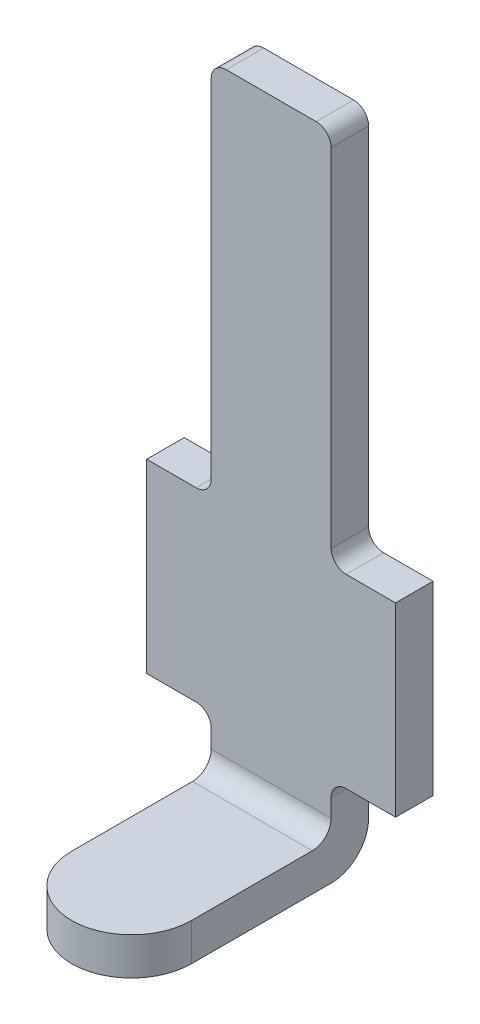
ISO-10303-21;
HEADER;
FILE_DESCRIPTION(('STEP AP214'),'2;1');
FILE_NAME('part.step','',(''),(''),'','','');
FILE_SCHEMA(('AUTOMOTIVE_DESIGN { 1 0 10303 214 1 1 1 1 }'));
ENDSEC;
DATA;
#1=APPLICATION_CONTEXT('core data for automotive mechanical design processes');
#2=APPLICATION_PROTOCOL_DEFINITION('international standard','automotive_design',2000,#1);
#3=PRODUCT_CONTEXT('',#1,'mechanical');
#4=PRODUCT('Part','Part','',(#3));
#5=PRODUCT_RELATED_PRODUCT_CATEGORY('part','',(#4));
#6=PRODUCT_DEFINITION_FORMATION('','',#4);
#7=PRODUCT_DEFINITION_CONTEXT('part definition',#1,'design');
#8=PRODUCT_DEFINITION('design','',#6,#7);
#9=PRODUCT_DEFINITION_SHAPE('','',#8);
#10=(LENGTH_UNIT() NAMED_UNIT(*) SI_UNIT(.MILLI.,.METRE.));
#11=(NAMED_UNIT(*) PLANE_ANGLE_UNIT() SI_UNIT($,.RADIAN.));
#12=(NAMED_UNIT(*) SI_UNIT($,.STERADIAN.) SOLID_ANGLE_UNIT());
#13=UNCERTAINTY_MEASURE_WITH_UNIT(LENGTH_MEASURE(1.E-05),#10,'distance_accuracy_value','');
#14=(GEOMETRIC_REPRESENTATION_CONTEXT(3) GLOBAL_UNCERTAINTY_ASSIGNED_CONTEXT((#13)) GLOBAL_UNIT_ASSIGNED_CONTEXT((#10,
#11,#12)) REPRESENTATION_CONTEXT('',''));
#15=CARTESIAN_POINT('',(0.,0.,0.));
#16=DIRECTION('',(0.,0.,1.));
#17=DIRECTION('',(1.,0.,0.));
#18=AXIS2_PLACEMENT_3D('',#15,#16,#17);
#19=CARTESIAN_POINT('',(3.31,0.0459658151929143,0.749000000000012));
#20=DIRECTION('',(0.,0.,-1.));
#21=DIRECTION('',(-1.,0.,0.));
#22=AXIS2_PLACEMENT_3D('',#19,#20,#21);
#23=CYLINDRICAL_SURFACE('',#22,0.1);
#24=CARTESIAN_POINT('',(3.31,0.0459658151929143,0.498999999999983));
#25=DIRECTION('',(0.,0.,1.));
#26=DIRECTION('',(1.,0.,0.));
#27=AXIS2_PLACEMENT_3D('',#24,#25,#26);
#28=CIRCLE('',#27,0.1);
#29=CARTESIAN_POINT('',(3.41,0.0459658151929143,0.498999999999983));
#30=VERTEX_POINT('',#29);
#31=CARTESIAN_POINT('',(3.31,0.145965815192914,0.499000000000012));
#32=VERTEX_POINT('',#31);
#33=EDGE_CURVE('E338',#30,#32,#28,.T.);
#34=ORIENTED_EDGE('',*,*,#33,.F.);
#35=DIRECTION('',(0.,0.,-1.));
#36=VECTOR('',#35,1.);
#37=CARTESIAN_POINT('',(3.41,0.0459658151929143,0.499000000000012));
#38=LINE('',#37,#36);
#39=CARTESIAN_POINT('',(3.41,0.0459658151929143,0.748999999999983));
#40=VERTEX_POINT('',#39);
#41=EDGE_CURVE('E293',#40,#30,#38,.T.);
#42=ORIENTED_EDGE('',*,*,#41,.F.);
#43=CARTESIAN_POINT('',(3.31,0.0459658151929143,0.748999999999983));
#44=DIRECTION('',(0.,0.,-1.));
#45=DIRECTION('',(-1.,0.,0.));
#46=AXIS2_PLACEMENT_3D('',#43,#44,#45);
#47=CIRCLE('',#46,0.1);
#48=CARTESIAN_POINT('',(3.31,0.145965815192914,0.749000000000012));
#49=VERTEX_POINT('',#48);
#50=EDGE_CURVE('E237',#49,#40,#47,.T.);
#51=ORIENTED_EDGE('',*,*,#50,.F.);
#52=DIRECTION('',(0.,0.,1.));
#53=VECTOR('',#52,1.);
#54=CARTESIAN_POINT('',(3.31,0.145965815192914,0.748999999999983));
#55=LINE('',#54,#53);
#56=EDGE_CURVE('E225',#32,#49,#55,.T.);
#57=ORIENTED_EDGE('',*,*,#56,.F.);
#58=EDGE_LOOP('',(#34,#42,#51,#57));
#59=FACE_BOUND('',#58,.T.);
#60=ADVANCED_FACE('F16',(#59),#23,.F.);
#61=CARTESIAN_POINT('',(4.31,0.0459658151929143,0.748999999999984));
#62=DIRECTION('',(0.,0.,1.));
#63=DIRECTION('',(1.,0.,0.));
#64=AXIS2_PLACEMENT_3D('',#61,#62,#63);
#65=CYLINDRICAL_SURFACE('',#64,0.1);
#66=CARTESIAN_POINT('',(4.31,0.0459658151929143,0.498999999999984));
#67=DIRECTION('',(0.,0.,1.));
#68=DIRECTION('',(1.,0.,0.));
#69=AXIS2_PLACEMENT_3D('',#66,#67,#68);
#70=CIRCLE('',#69,0.1);
#71=CARTESIAN_POINT('',(4.31,0.145965815192914,0.499000000000013));
#72=VERTEX_POINT('',#71);
#73=CARTESIAN_POINT('',(4.21,0.0459658151929143,0.498999999999984));
#74=VERTEX_POINT('',#73);
#75=EDGE_CURVE('E236',#72,#74,#70,.T.);
#76=ORIENTED_EDGE('',*,*,#75,.F.);
#77=DIRECTION('',(0.,0.,-1.));
#78=VECTOR('',#77,1.);
#79=CARTESIAN_POINT('',(4.31,0.145965815192914,0.749000000000013));
#80=LINE('',#79,#78);
#81=CARTESIAN_POINT('',(4.31,0.145965815192914,0.749000000000013));
#82=VERTEX_POINT('',#81);
#83=EDGE_CURVE('E27',#82,#72,#80,.T.);
#84=ORIENTED_EDGE('',*,*,#83,.F.);
#85=CARTESIAN_POINT('',(4.31,0.0459658151929143,0.748999999999984));
#86=DIRECTION('',(0.,0.,-1.));
#87=DIRECTION('',(-1.,0.,0.));
#88=AXIS2_PLACEMENT_3D('',#85,#86,#87);
#89=CIRCLE('',#88,0.1);
#90=CARTESIAN_POINT('',(4.21,0.0459658151929143,0.748999999999984));
#91=VERTEX_POINT('',#90);
#92=EDGE_CURVE('E387',#91,#82,#89,.T.);
#93=ORIENTED_EDGE('',*,*,#92,.F.);
#94=DIRECTION('',(0.,0.,1.));
#95=VECTOR('',#94,1.);
#96=CARTESIAN_POINT('',(4.21,0.0459658151929143,0.748999999999984));
#97=LINE('',#96,#95);
#98=EDGE_CURVE('E260',#74,#91,#97,.T.);
#99=ORIENTED_EDGE('',*,*,#98,.F.);
#100=EDGE_LOOP('',(#76,#84,#93,#99));
#101=FACE_BOUND('',#100,.T.);
#102=ADVANCED_FACE('F637',(#101),#65,.F.);
#103=CARTESIAN_POINT('',(3.31,1.48437551370885,0.748999999999983));
#104=DIRECTION('',(0.,0.,1.));
#105=DIRECTION('',(1.,0.,0.));
#106=AXIS2_PLACEMENT_3D('',#103,#104,#105);
#107=CYLINDRICAL_SURFACE('',#106,0.1);
#108=CARTESIAN_POINT('',(3.31,1.48437551370885,0.498999999999983));
#109=DIRECTION('',(0.,0.,1.));
#110=DIRECTION('',(1.,0.,0.));
#111=AXIS2_PLACEMENT_3D('',#108,#109,#110);
#112=CIRCLE('',#111,0.1);
#113=CARTESIAN_POINT('',(3.31,1.38437551370885,0.499000000000012));
#114=VERTEX_POINT('',#113);
#115=CARTESIAN_POINT('',(3.41,1.48437551370885,0.498999999999983));
#116=VERTEX_POINT('',#115);
#117=EDGE_CURVE('E255',#114,#116,#112,.T.);
#118=ORIENTED_EDGE('',*,*,#117,.F.);
#119=DIRECTION('',(0.,0.,-1.));
#120=VECTOR('',#119,1.);
#121=CARTESIAN_POINT('',(3.31,1.38437551370885,0.749000000000012));
#122=LINE('',#121,#120);
#123=CARTESIAN_POINT('',(3.31,1.38437551370885,0.749000000000012));
#124=VERTEX_POINT('',#123);
#125=EDGE_CURVE('E42',#124,#114,#122,.T.);
#126=ORIENTED_EDGE('',*,*,#125,.F.);
#127=CARTESIAN_POINT('',(3.31,1.48437551370885,0.748999999999983));
#128=DIRECTION('',(0.,0.,-1.));
#129=DIRECTION('',(-1.,0.,0.));
#130=AXIS2_PLACEMENT_3D('',#127,#128,#129);
#131=CIRCLE('',#130,0.1);
#132=CARTESIAN_POINT('',(3.41,1.48437551370885,0.748999999999983));
#133=VERTEX_POINT('',#132);
#134=EDGE_CURVE('E264',#133,#124,#131,.T.);
#135=ORIENTED_EDGE('',*,*,#134,.F.);
#136=DIRECTION('',(0.,0.,1.));
#137=VECTOR('',#136,1.);
#138=CARTESIAN_POINT('',(3.41,1.48437551370885,0.748999999999983));
#139=LINE('',#138,#137);
#140=EDGE_CURVE('E231',#116,#133,#139,.T.);
#141=ORIENTED_EDGE('',*,*,#140,.F.);
#142=EDGE_LOOP('',(#118,#126,#135,#141));
#143=FACE_BOUND('',#142,.T.);
#144=ADVANCED_FACE('F681',(#143),#107,.F.);
#145=CARTESIAN_POINT('',(4.31,1.48437551370885,0.749000000000014));
#146=DIRECTION('',(0.,0.,-1.));
#147=DIRECTION('',(-1.,0.,0.));
#148=AXIS2_PLACEMENT_3D('',#145,#146,#147);
#149=CYLINDRICAL_SURFACE('',#148,0.1);
#150=CARTESIAN_POINT('',(4.31,1.48437551370885,0.498999999999985));
#151=DIRECTION('',(0.,0.,1.));
#152=DIRECTION('',(1.,0.,0.));
#153=AXIS2_PLACEMENT_3D('',#150,#151,#152);
#154=CIRCLE('',#153,0.1);
#155=CARTESIAN_POINT('',(4.21,1.48437551370885,0.498999999999984));
#156=VERTEX_POINT('',#155);
#157=CARTESIAN_POINT('',(4.31,1.38437551370885,0.499000000000013));
#158=VERTEX_POINT('',#157);
#159=EDGE_CURVE('E379',#156,#158,#154,.T.);
#160=ORIENTED_EDGE('',*,*,#159,.F.);
#161=DIRECTION('',(0.,0.,-1.));
#162=VECTOR('',#161,1.);
#163=CARTESIAN_POINT('',(4.21,1.48437551370885,0.498999999999984));
#164=LINE('',#163,#162);
#165=CARTESIAN_POINT('',(4.21,1.48437551370885,0.748999999999984));
#166=VERTEX_POINT('',#165);
#167=EDGE_CURVE('E280',#166,#156,#164,.T.);
#168=ORIENTED_EDGE('',*,*,#167,.F.);
#169=CARTESIAN_POINT('',(4.31,1.48437551370885,0.748999999999984));
#170=DIRECTION('',(0.,0.,-1.));
#171=DIRECTION('',(-1.,0.,0.));
#172=AXIS2_PLACEMENT_3D('',#169,#170,#171);
#173=CIRCLE('',#172,0.1);
#174=CARTESIAN_POINT('',(4.31,1.38437551370885,0.749000000000014));
#175=VERTEX_POINT('',#174);
#176=EDGE_CURVE('E221',#175,#166,#173,.T.);
#177=ORIENTED_EDGE('',*,*,#176,.F.);
#178=DIRECTION('',(0.,0.,1.));
#179=VECTOR('',#178,1.);
#180=CARTESIAN_POINT('',(4.31,1.38437551370885,0.748999999999984));
#181=LINE('',#180,#179);
#182=EDGE_CURVE('E374',#158,#175,#181,.T.);
#183=ORIENTED_EDGE('',*,*,#182,.F.);
#184=EDGE_LOOP('',(#160,#168,#177,#183));
#185=FACE_BOUND('',#184,.T.);
#186=ADVANCED_FACE('F705',(#185),#149,.F.);
#187=CARTESIAN_POINT('',(3.51,3.8,0.748999999999983));
#188=DIRECTION('',(0.,0.,-1.));
#189=DIRECTION('',(-1.,0.,0.));
#190=AXIS2_PLACEMENT_3D('',#187,#188,#189);
#191=CYLINDRICAL_SURFACE('',#190,0.1);
#192=CARTESIAN_POINT('',(3.51,3.8,0.498999999999984));
#193=DIRECTION('',(0.,0.,-1.));
#194=DIRECTION('',(1.,0.,0.));
#195=AXIS2_PLACEMENT_3D('',#192,#193,#194);
#196=CIRCLE('',#195,0.1);
#197=CARTESIAN_POINT('',(3.41,3.8,0.498999999999984));
#198=VERTEX_POINT('',#197);
#199=CARTESIAN_POINT('',(3.51,3.9,0.498999999999984));
#200=VERTEX_POINT('',#199);
#201=EDGE_CURVE('E258',#198,#200,#196,.T.);
#202=ORIENTED_EDGE('',*,*,#201,.F.);
#203=DIRECTION('',(0.,0.,-1.));
#204=VECTOR('',#203,1.);
#205=CARTESIAN_POINT('',(3.41,3.8,0.498999999999984));
#206=LINE('',#205,#204);
#207=CARTESIAN_POINT('',(3.41,3.8,0.748999999999983));
#208=VERTEX_POINT('',#207);
#209=EDGE_CURVE('E394',#208,#198,#206,.T.);
#210=ORIENTED_EDGE('',*,*,#209,.F.);
#211=CARTESIAN_POINT('',(3.51,3.8,0.748999999999983));
#212=DIRECTION('',(0.,0.,1.));
#213=DIRECTION('',(-1.,0.,0.));
#214=AXIS2_PLACEMENT_3D('',#211,#212,#213);
#215=CIRCLE('',#214,0.1);
#216=CARTESIAN_POINT('',(3.51,3.9,0.748999999999983));
#217=VERTEX_POINT('',#216);
#218=EDGE_CURVE('E269',#217,#208,#215,.T.);
#219=ORIENTED_EDGE('',*,*,#218,.F.);
#220=DIRECTION('',(0.,0.,1.));
#221=VECTOR('',#220,1.);
#222=CARTESIAN_POINT('',(3.51,3.9,0.748999999999983));
#223=LINE('',#222,#221);
#224=EDGE_CURVE('E286',#200,#217,#223,.T.);
#225=ORIENTED_EDGE('',*,*,#224,.F.);
#226=EDGE_LOOP('',(#202,#210,#219,#225));
#227=FACE_BOUND('',#226,.T.);
#228=ADVANCED_FACE('F357',(#227),#191,.T.);
#229=CARTESIAN_POINT('',(4.11,3.8,0.748999999999984));
#230=DIRECTION('',(0.,0.,1.));
#231=DIRECTION('',(1.,0.,0.));
#232=AXIS2_PLACEMENT_3D('',#229,#230,#231);
#233=CYLINDRICAL_SURFACE('',#232,0.1);
#234=CARTESIAN_POINT('',(4.11,3.8,0.498999999999985));
#235=DIRECTION('',(0.,0.,-1.));
#236=DIRECTION('',(1.,0.,0.));
#237=AXIS2_PLACEMENT_3D('',#234,#235,#236);
#238=CIRCLE('',#237,0.1);
#239=CARTESIAN_POINT('',(4.11,3.9,0.498999999999985));
#240=VERTEX_POINT('',#239);
#241=CARTESIAN_POINT('',(4.21,3.8,0.498999999999985));
#242=VERTEX_POINT('',#241);
#243=EDGE_CURVE('E20',#240,#242,#238,.T.);
#244=ORIENTED_EDGE('',*,*,#243,.F.);
#245=DIRECTION('',(0.,0.,-1.));
#246=VECTOR('',#245,1.);
#247=CARTESIAN_POINT('',(4.11,3.9,0.748999999999984));
#248=LINE('',#247,#246);
#249=CARTESIAN_POINT('',(4.11,3.9,0.748999999999984));
#250=VERTEX_POINT('',#249);
#251=EDGE_CURVE('E230',#250,#240,#248,.T.);
#252=ORIENTED_EDGE('',*,*,#251,.F.);
#253=CARTESIAN_POINT('',(4.11,3.8,0.748999999999984));
#254=DIRECTION('',(0.,0.,1.));
#255=DIRECTION('',(-1.,0.,0.));
#256=AXIS2_PLACEMENT_3D('',#253,#254,#255);
#257=CIRCLE('',#256,0.1);
#258=CARTESIAN_POINT('',(4.21,3.8,0.748999999999984));
#259=VERTEX_POINT('',#258);
#260=EDGE_CURVE('E290',#259,#250,#257,.T.);
#261=ORIENTED_EDGE('',*,*,#260,.F.);
#262=DIRECTION('',(0.,0.,1.));
#263=VECTOR('',#262,1.);
#264=CARTESIAN_POINT('',(4.21,3.8,0.748999999999984));
#265=LINE('',#264,#263);
#266=EDGE_CURVE('E411',#242,#259,#265,.T.);
#267=ORIENTED_EDGE('',*,*,#266,.F.);
#268=EDGE_LOOP('',(#244,#252,#261,#267));
#269=FACE_BOUND('',#268,.T.);
#270=ADVANCED_FACE('F745',(#269),#233,.T.);
#271=CARTESIAN_POINT('',(4.64,0.,1.00308650274883E-13));
#272=DIRECTION('',(-1.,0.,0.));
#273=DIRECTION('',(0.,0.,1.));
#274=AXIS2_PLACEMENT_3D('',#271,#272,#273);
#275=PLANE('',#274);
#276=DIRECTION('',(0.,0.,-1.));
#277=VECTOR('',#276,1.);
#278=CARTESIAN_POINT('',(4.64,1.38437551370885,0.749000000000014));
#279=LINE('',#278,#277);
#280=CARTESIAN_POINT('',(4.64,1.38437551370885,0.749000000000014));
#281=VERTEX_POINT('',#280);
#282=CARTESIAN_POINT('',(4.64,1.38437551370885,0.499000000000014));
#283=VERTEX_POINT('',#282);
#284=EDGE_CURVE('E279',#281,#283,#279,.T.);
#285=ORIENTED_EDGE('',*,*,#284,.F.);
#286=DIRECTION('',(0.,-1.,0.));
#287=VECTOR('',#286,1.);
#288=CARTESIAN_POINT('',(4.64,1.38437551370885,0.749000000000014));
#289=LINE('',#288,#287);
#290=CARTESIAN_POINT('',(4.64,0.145965815192914,0.749000000000014));
#291=VERTEX_POINT('',#290);
#292=EDGE_CURVE('E402',#281,#291,#289,.T.);
#293=ORIENTED_EDGE('',*,*,#292,.T.);
#294=DIRECTION('',(0.,0.,-1.));
#295=VECTOR('',#294,1.);
#296=CARTESIAN_POINT('',(4.64,0.145965815192914,0.749000000000014));
#297=LINE('',#296,#295);
#298=CARTESIAN_POINT('',(4.64,0.145965815192914,0.499000000000014));
#299=VERTEX_POINT('',#298);
#300=EDGE_CURVE('E11',#291,#299,#297,.T.);
#301=ORIENTED_EDGE('',*,*,#300,.T.);
#302=DIRECTION('',(0.,-1.,0.));
#303=VECTOR('',#302,1.);
#304=CARTESIAN_POINT('',(4.64,1.38437551370885,0.499000000000014));
#305=LINE('',#304,#303);
#306=EDGE_CURVE('E276',#283,#299,#305,.T.);
#307=ORIENTED_EDGE('',*,*,#306,.F.);
#308=EDGE_LOOP('',(#285,#293,#301,#307));
#309=FACE_BOUND('',#308,.T.);
#310=ADVANCED_FACE('F459',(#309),#275,.F.);
#311=CARTESIAN_POINT('',(2.98,0.145965815192914,0.749000000000011));
#312=DIRECTION('',(0.,-1.,0.));
#313=DIRECTION('',(0.,0.,-1.));
#314=AXIS2_PLACEMENT_3D('',#311,#312,#313);
#315=PLANE('',#314);
#316=DIRECTION('',(1.,0.,0.));
#317=VECTOR('',#316,1.);
#318=CARTESIAN_POINT('',(2.98,0.145965815192914,0.749000000000011));
#319=LINE('',#318,#317);
#320=EDGE_CURVE('E391',#82,#291,#319,.T.);
#321=ORIENTED_EDGE('',*,*,#320,.F.);
#322=ORIENTED_EDGE('',*,*,#83,.T.);
#323=DIRECTION('',(1.,0.,0.));
#324=VECTOR('',#323,1.);
#325=CARTESIAN_POINT('',(2.98,0.145965815192914,0.499000000000011));
#326=LINE('',#325,#324);
#327=EDGE_CURVE('E272',#72,#299,#326,.T.);
#328=ORIENTED_EDGE('',*,*,#327,.T.);
#329=ORIENTED_EDGE('',*,*,#300,.F.);
#330=EDGE_LOOP('',(#321,#322,#328,#329));
#331=FACE_BOUND('',#330,.T.);
#332=ADVANCED_FACE('F724',(#331),#315,.T.);
#333=CARTESIAN_POINT('',(2.98,1.38437551370885,0.749000000000012));
#334=DIRECTION('',(0.,-1.,0.));
#335=DIRECTION('',(0.,0.,-1.));
#336=AXIS2_PLACEMENT_3D('',#333,#334,#335);
#337=PLANE('',#336);
#338=DIRECTION('',(1.,0.,0.));
#339=VECTOR('',#338,1.);
#340=CARTESIAN_POINT('',(2.98,1.38437551370885,0.499000000000011));
#341=LINE('',#340,#339);
#342=EDGE_CURVE('E298',#158,#283,#341,.T.);
#343=ORIENTED_EDGE('',*,*,#342,.F.);
#344=ORIENTED_EDGE('',*,*,#182,.T.);
#345=DIRECTION('',(1.,0.,0.));
#346=VECTOR('',#345,1.);
#347=CARTESIAN_POINT('',(2.98,1.38437551370885,0.749000000000012));
#348=LINE('',#347,#346);
#349=EDGE_CURVE('E254',#175,#281,#348,.T.);
#350=ORIENTED_EDGE('',*,*,#349,.T.);
#351=ORIENTED_EDGE('',*,*,#284,.T.);
#352=EDGE_LOOP('',(#343,#344,#350,#351));
#353=FACE_BOUND('',#352,.T.);
#354=ADVANCED_FACE('F451',(#353),#337,.F.);
#355=CARTESIAN_POINT('',(2.98,1.38437551370885,0.749000000000012));
#356=DIRECTION('',(0.,-1.,0.));
#357=DIRECTION('',(0.,0.,-1.));
#358=AXIS2_PLACEMENT_3D('',#355,#356,#357);
#359=PLANE('',#358);
#360=DIRECTION('',(1.,0.,0.));
#361=VECTOR('',#360,1.);
#362=CARTESIAN_POINT('',(2.98,1.38437551370885,0.749000000000012));
#363=LINE('',#362,#361);
#364=CARTESIAN_POINT('',(2.98,1.38437551370885,0.749000000000012));
#365=VERTEX_POINT('',#364);
#366=EDGE_CURVE('E268',#365,#124,#363,.T.);
#367=ORIENTED_EDGE('',*,*,#366,.T.);
#368=ORIENTED_EDGE('',*,*,#125,.T.);
#369=DIRECTION('',(1.,0.,0.));
#370=VECTOR('',#369,1.);
#371=CARTESIAN_POINT('',(2.98,1.38437551370885,0.499000000000011));
#372=LINE('',#371,#370);
#373=CARTESIAN_POINT('',(2.98,1.38437551370885,0.499000000000011));
#374=VERTEX_POINT('',#373);
#375=EDGE_CURVE('E259',#374,#114,#372,.T.);
#376=ORIENTED_EDGE('',*,*,#375,.F.);
#377=DIRECTION('',(0.,0.,-1.));
#378=VECTOR('',#377,1.);
#379=CARTESIAN_POINT('',(2.98,1.38437551370885,0.749000000000012));
#380=LINE('',#379,#378);
#381=EDGE_CURVE('E307',#365,#374,#380,.T.);
#382=ORIENTED_EDGE('',*,*,#381,.F.);
#383=EDGE_LOOP('',(#367,#368,#376,#382));
#384=FACE_BOUND('',#383,.T.);
#385=ADVANCED_FACE('F768',(#384),#359,.F.);
#386=CARTESIAN_POINT('',(2.98,0.145965815192914,0.749000000000011));
#387=DIRECTION('',(0.,-1.,0.));
#388=DIRECTION('',(0.,0.,-1.));
#389=AXIS2_PLACEMENT_3D('',#386,#387,#388);
#390=PLANE('',#389);
#391=DIRECTION('',(1.,0.,0.));
#392=VECTOR('',#391,1.);
#393=CARTESIAN_POINT('',(2.98,0.145965815192914,0.499000000000011));
#394=LINE('',#393,#392);
#395=CARTESIAN_POINT('',(2.98,0.145965815192914,0.499000000000011));
#396=VERTEX_POINT('',#395);
#397=EDGE_CURVE('E398',#396,#32,#394,.T.);
#398=ORIENTED_EDGE('',*,*,#397,.T.);
#399=ORIENTED_EDGE('',*,*,#56,.T.);
#400=DIRECTION('',(1.,0.,0.));
#401=VECTOR('',#400,1.);
#402=CARTESIAN_POINT('',(2.98,0.145965815192914,0.749000000000011));
#403=LINE('',#402,#401);
#404=CARTESIAN_POINT('',(2.98,0.145965815192914,0.749000000000011));
#405=VERTEX_POINT('',#404);
#406=EDGE_CURVE('E242',#405,#49,#403,.T.);
#407=ORIENTED_EDGE('',*,*,#406,.F.);
#408=DIRECTION('',(0.,0.,-1.));
#409=VECTOR('',#408,1.);
#410=CARTESIAN_POINT('',(2.98,0.145965815192914,0.749000000000011));
#411=LINE('',#410,#409);
#412=EDGE_CURVE('E303',#405,#396,#411,.T.);
#413=ORIENTED_EDGE('',*,*,#412,.T.);
#414=EDGE_LOOP('',(#398,#399,#407,#413));
#415=FACE_BOUND('',#414,.T.);
#416=ADVANCED_FACE('F675',(#415),#390,.T.);
#417=CARTESIAN_POINT('',(2.98,0.,0.));
#418=DIRECTION('',(-1.,0.,0.));
#419=DIRECTION('',(0.,0.,1.));
#420=AXIS2_PLACEMENT_3D('',#417,#418,#419);
#421=PLANE('',#420);
#422=ORIENTED_EDGE('',*,*,#381,.T.);
#423=DIRECTION('',(0.,-1.,0.));
#424=VECTOR('',#423,1.);
#425=CARTESIAN_POINT('',(2.98,1.38437551370885,0.499000000000011));
#426=LINE('',#425,#424);
#427=EDGE_CURVE('E334',#374,#396,#426,.T.);
#428=ORIENTED_EDGE('',*,*,#427,.T.);
#429=ORIENTED_EDGE('',*,*,#412,.F.);
#430=DIRECTION('',(0.,-1.,0.));
#431=VECTOR('',#430,1.);
#432=CARTESIAN_POINT('',(2.98,1.38437551370885,0.749000000000012));
#433=LINE('',#432,#431);
#434=EDGE_CURVE('E314',#365,#405,#433,.T.);
#435=ORIENTED_EDGE('',*,*,#434,.F.);
#436=EDGE_LOOP('',(#422,#428,#429,#435));
#437=FACE_BOUND('',#436,.T.);
#438=ADVANCED_FACE('F677',(#437),#421,.T.);
#439=CARTESIAN_POINT('',(3.81,-0.2,1.68));
#440=DIRECTION('',(0.,-1.,0.));
#441=DIRECTION('',(0.,0.,-1.));
#442=AXIS2_PLACEMENT_3D('',#439,#440,#441);
#443=CYLINDRICAL_SURFACE('',#442,0.4);
#444=DIRECTION('',(0.,-1.,0.));
#445=VECTOR('',#444,1.);
#446=CARTESIAN_POINT('',(4.21,-0.2,1.68));
#447=LINE('',#446,#445);
#448=CARTESIAN_POINT('',(4.21,-0.2,1.68));
#449=VERTEX_POINT('',#448);
#450=CARTESIAN_POINT('',(4.21,-0.45,1.68));
#451=VERTEX_POINT('',#450);
#452=EDGE_CURVE('E263',#449,#451,#447,.T.);
#453=ORIENTED_EDGE('',*,*,#452,.F.);
#454=CARTESIAN_POINT('',(3.81,-0.2,1.68));
#455=DIRECTION('',(0.,1.,0.));
#456=DIRECTION('',(0.,0.,-1.));
#457=AXIS2_PLACEMENT_3D('',#454,#455,#456);
#458=CIRCLE('',#457,0.4);
#459=CARTESIAN_POINT('',(3.41,-0.2,1.68));
#460=VERTEX_POINT('',#459);
#461=EDGE_CURVE('E195',#460,#449,#458,.T.);
#462=ORIENTED_EDGE('',*,*,#461,.F.);
#463=DIRECTION('',(0.,1.,0.));
#464=VECTOR('',#463,1.);
#465=CARTESIAN_POINT('',(3.41,-0.2,1.68));
#466=LINE('',#465,#464);
#467=CARTESIAN_POINT('',(3.41,-0.45,1.68));
#468=VERTEX_POINT('',#467);
#469=EDGE_CURVE('E421',#468,#460,#466,.T.);
#470=ORIENTED_EDGE('',*,*,#469,.F.);
#471=CARTESIAN_POINT('',(3.81,-0.45,1.68));
#472=DIRECTION('',(0.,-1.,0.));
#473=DIRECTION('',(0.,0.,1.));
#474=AXIS2_PLACEMENT_3D('',#471,#472,#473);
#475=CIRCLE('',#474,0.4);
#476=EDGE_CURVE('E198',#451,#468,#475,.T.);
#477=ORIENTED_EDGE('',*,*,#476,.F.);
#478=EDGE_LOOP('',(#453,#462,#470,#477));
#479=FACE_BOUND('',#478,.T.);
#480=ADVANCED_FACE('F704',(#479),#443,.T.);
#481=CARTESIAN_POINT('',(3.41,-0.2,0.748999999999983));
#482=DIRECTION('',(-1.,0.,0.));
#483=DIRECTION('',(0.,0.,1.));
#484=AXIS2_PLACEMENT_3D('',#481,#482,#483);
#485=PLANE('',#484);
#486=DIRECTION('',(0.,-1.,0.));
#487=VECTOR('',#486,1.);
#488=CARTESIAN_POINT('',(3.41,3.9,0.748999999999983));
#489=LINE('',#488,#487);
#490=CARTESIAN_POINT('',(3.41,-0.0749999999999988,0.748999999999983));
#491=VERTEX_POINT('',#490);
#492=EDGE_CURVE('E241',#40,#491,#489,.T.);
#493=ORIENTED_EDGE('',*,*,#492,.F.);
#494=ORIENTED_EDGE('',*,*,#41,.T.);
#495=DIRECTION('',(0.,1.,0.));
#496=VECTOR('',#495,1.);
#497=CARTESIAN_POINT('',(3.41,3.9,0.498999999999984));
#498=LINE('',#497,#496);
#499=CARTESIAN_POINT('',(3.41,-0.2,0.498999999999983));
#500=VERTEX_POINT('',#499);
#501=EDGE_CURVE('E235',#500,#30,#498,.T.);
#502=ORIENTED_EDGE('',*,*,#501,.F.);
#503=CARTESIAN_POINT('',(3.41,-0.2,0.748999999999983));
#504=DIRECTION('',(1.,0.,0.));
#505=DIRECTION('',(0.,0.,1.));
#506=AXIS2_PLACEMENT_3D('',#503,#504,#505);
#507=CIRCLE('',#506,0.25);
#508=CARTESIAN_POINT('',(3.41,-0.45,0.748999999999983));
#509=VERTEX_POINT('',#508);
#510=EDGE_CURVE('E382',#509,#500,#507,.T.);
#511=ORIENTED_EDGE('',*,*,#510,.F.);
#512=DIRECTION('',(0.,0.,-1.));
#513=VECTOR('',#512,1.);
#514=CARTESIAN_POINT('',(3.41,-0.45,0.748999999999983));
#515=LINE('',#514,#513);
#516=EDGE_CURVE('E243',#468,#509,#515,.T.);
#517=ORIENTED_EDGE('',*,*,#516,.F.);
#518=ORIENTED_EDGE('',*,*,#469,.T.);
#519=DIRECTION('',(0.,0.,1.));
#520=VECTOR('',#519,1.);
#521=CARTESIAN_POINT('',(3.41,-0.2,0.873999999999983));
#522=LINE('',#521,#520);
#523=CARTESIAN_POINT('',(3.41,-0.2,0.873999999999983));
#524=VERTEX_POINT('',#523);
#525=EDGE_CURVE('E210',#524,#460,#522,.T.);
#526=ORIENTED_EDGE('',*,*,#525,.F.);
#527=CARTESIAN_POINT('',(3.41,-0.0749999999999988,0.873999999999983));
#528=DIRECTION('',(-1.,0.,0.));
#529=DIRECTION('',(0.,0.,1.));
#530=AXIS2_PLACEMENT_3D('',#527,#528,#529);
#531=CIRCLE('',#530,0.125);
#532=EDGE_CURVE('E213',#491,#524,#531,.T.);
#533=ORIENTED_EDGE('',*,*,#532,.F.);
#534=EDGE_LOOP('',(#493,#494,#502,#511,#517,#518,#526,#533));
#535=FACE_BOUND('',#534,.T.);
#536=ADVANCED_FACE('F631',(#535),#485,.T.);
#537=CARTESIAN_POINT('',(4.21,-0.2,0.748999999999984));
#538=DIRECTION('',(-1.,0.,0.));
#539=DIRECTION('',(0.,0.,1.));
#540=AXIS2_PLACEMENT_3D('',#537,#538,#539);
#541=PLANE('',#540);
#542=DIRECTION('',(0.,1.,0.));
#543=VECTOR('',#542,1.);
#544=CARTESIAN_POINT('',(4.21,3.9,0.498999999999985));
#545=LINE('',#544,#543);
#546=CARTESIAN_POINT('',(4.21,-0.2,0.498999999999984));
#547=VERTEX_POINT('',#546);
#548=EDGE_CURVE('E232',#547,#74,#545,.T.);
#549=ORIENTED_EDGE('',*,*,#548,.T.);
#550=ORIENTED_EDGE('',*,*,#98,.T.);
#551=DIRECTION('',(0.,-1.,0.));
#552=VECTOR('',#551,1.);
#553=CARTESIAN_POINT('',(4.21,3.9,0.748999999999984));
#554=LINE('',#553,#552);
#555=CARTESIAN_POINT('',(4.21,-0.0749999999999988,0.748999999999984));
#556=VERTEX_POINT('',#555);
#557=EDGE_CURVE('E205',#91,#556,#554,.T.);
#558=ORIENTED_EDGE('',*,*,#557,.T.);
#559=CARTESIAN_POINT('',(4.21,-0.0749999999999988,0.873999999999984));
#560=DIRECTION('',(-1.,0.,0.));
#561=DIRECTION('',(0.,0.,1.));
#562=AXIS2_PLACEMENT_3D('',#559,#560,#561);
#563=CIRCLE('',#562,0.125);
#564=CARTESIAN_POINT('',(4.21,-0.2,0.873999999999984));
#565=VERTEX_POINT('',#564);
#566=EDGE_CURVE('E201',#556,#565,#563,.T.);
#567=ORIENTED_EDGE('',*,*,#566,.T.);
#568=DIRECTION('',(0.,0.,1.));
#569=VECTOR('',#568,1.);
#570=CARTESIAN_POINT('',(4.21,-0.2,0.873999999999984));
#571=LINE('',#570,#569);
#572=EDGE_CURVE('E187',#565,#449,#571,.T.);
#573=ORIENTED_EDGE('',*,*,#572,.T.);
#574=ORIENTED_EDGE('',*,*,#452,.T.);
#575=DIRECTION('',(0.,0.,-1.));
#576=VECTOR('',#575,1.);
#577=CARTESIAN_POINT('',(4.21,-0.45,0.748999999999984));
#578=LINE('',#577,#576);
#579=CARTESIAN_POINT('',(4.21,-0.45,0.748999999999984));
#580=VERTEX_POINT('',#579);
#581=EDGE_CURVE('E313',#451,#580,#578,.T.);
#582=ORIENTED_EDGE('',*,*,#581,.T.);
#583=CARTESIAN_POINT('',(4.21,-0.2,0.748999999999984));
#584=DIRECTION('',(1.,0.,0.));
#585=DIRECTION('',(0.,0.,1.));
#586=AXIS2_PLACEMENT_3D('',#583,#584,#585);
#587=CIRCLE('',#586,0.25);
#588=EDGE_CURVE('E415',#580,#547,#587,.T.);
#589=ORIENTED_EDGE('',*,*,#588,.T.);
#590=EDGE_LOOP('',(#549,#550,#558,#567,#573,#574,#582,#589));
#591=FACE_BOUND('',#590,.T.);
#592=ADVANCED_FACE('F203',(#591),#541,.F.);
#593=CARTESIAN_POINT('',(4.21,3.9,0.498999999999985));
#594=DIRECTION('',(0.,0.,1.));
#595=DIRECTION('',(1.,0.,0.));
#596=AXIS2_PLACEMENT_3D('',#593,#594,#595);
#597=PLANE('',#596);
#598=DIRECTION('',(-1.,0.,0.));
#599=VECTOR('',#598,1.);
#600=CARTESIAN_POINT('',(4.21,3.9,0.498999999999985));
#601=LINE('',#600,#599);
#602=EDGE_CURVE('E291',#240,#200,#601,.T.);
#603=ORIENTED_EDGE('',*,*,#602,.F.);
#604=ORIENTED_EDGE('',*,*,#243,.T.);
#605=DIRECTION('',(0.,1.,0.));
#606=VECTOR('',#605,1.);
#607=CARTESIAN_POINT('',(4.21,3.9,0.498999999999985));
#608=LINE('',#607,#606);
#609=EDGE_CURVE('E372',#156,#242,#608,.T.);
#610=ORIENTED_EDGE('',*,*,#609,.F.);
#611=ORIENTED_EDGE('',*,*,#159,.T.);
#612=ORIENTED_EDGE('',*,*,#342,.T.);
#613=ORIENTED_EDGE('',*,*,#306,.T.);
#614=ORIENTED_EDGE('',*,*,#327,.F.);
#615=ORIENTED_EDGE('',*,*,#75,.T.);
#616=ORIENTED_EDGE('',*,*,#548,.F.);
#617=DIRECTION('',(-1.,0.,0.));
#618=VECTOR('',#617,1.);
#619=CARTESIAN_POINT('',(4.21,-0.2,0.498999999999984));
#620=LINE('',#619,#618);
#621=EDGE_CURVE('E386',#547,#500,#620,.T.);
#622=ORIENTED_EDGE('',*,*,#621,.T.);
#623=ORIENTED_EDGE('',*,*,#501,.T.);
#624=ORIENTED_EDGE('',*,*,#33,.T.);
#625=ORIENTED_EDGE('',*,*,#397,.F.);
#626=ORIENTED_EDGE('',*,*,#427,.F.);
#627=ORIENTED_EDGE('',*,*,#375,.T.);
#628=ORIENTED_EDGE('',*,*,#117,.T.);
#629=DIRECTION('',(0.,1.,0.));
#630=VECTOR('',#629,1.);
#631=CARTESIAN_POINT('',(3.41,3.9,0.498999999999984));
#632=LINE('',#631,#630);
#633=EDGE_CURVE('E302',#116,#198,#632,.T.);
#634=ORIENTED_EDGE('',*,*,#633,.T.);
#635=ORIENTED_EDGE('',*,*,#201,.T.);
#636=EDGE_LOOP('',(#603,#604,#610,#611,#612,#613,#614,#615,#616,#622,#623,#624,#625,#626,#627,
#628,#634,#635));
#637=FACE_BOUND('',#636,.T.);
#638=ADVANCED_FACE('F349',(#637),#597,.F.);
#639=CARTESIAN_POINT('',(4.21,-0.2,0.748999999999984));
#640=DIRECTION('',(-1.,0.,0.));
#641=DIRECTION('',(0.,0.,1.));
#642=AXIS2_PLACEMENT_3D('',#639,#640,#641);
#643=CYLINDRICAL_SURFACE('',#642,0.25);
#644=ORIENTED_EDGE('',*,*,#510,.T.);
#645=ORIENTED_EDGE('',*,*,#621,.F.);
#646=ORIENTED_EDGE('',*,*,#588,.F.);
#647=DIRECTION('',(-1.,0.,0.));
#648=VECTOR('',#647,1.);
#649=CARTESIAN_POINT('',(4.21,-0.45,0.748999999999984));
#650=LINE('',#649,#648);
#651=EDGE_CURVE('E247',#580,#509,#650,.T.);
#652=ORIENTED_EDGE('',*,*,#651,.T.);
#653=EDGE_LOOP('',(#644,#645,#646,#652));
#654=FACE_BOUND('',#653,.T.);
#655=ADVANCED_FACE('F620',(#654),#643,.T.);
#656=CARTESIAN_POINT('',(4.21,-0.45,0.748999999999984));
#657=DIRECTION('',(0.,1.,0.));
#658=DIRECTION('',(0.,0.,-1.));
#659=AXIS2_PLACEMENT_3D('',#656,#657,#658);
#660=PLANE('',#659);
#661=ORIENTED_EDGE('',*,*,#476,.T.);
#662=ORIENTED_EDGE('',*,*,#516,.T.);
#663=ORIENTED_EDGE('',*,*,#651,.F.);
#664=ORIENTED_EDGE('',*,*,#581,.F.);
#665=EDGE_LOOP('',(#661,#662,#663,#664));
#666=FACE_BOUND('',#665,.T.);
#667=ADVANCED_FACE('F627',(#666),#660,.F.);
#668=CARTESIAN_POINT('',(4.21,-0.2,0.873999999999984));
#669=DIRECTION('',(0.,-1.,0.));
#670=DIRECTION('',(0.,0.,-1.));
#671=AXIS2_PLACEMENT_3D('',#668,#669,#670);
#672=PLANE('',#671);
#673=ORIENTED_EDGE('',*,*,#525,.T.);
#674=ORIENTED_EDGE('',*,*,#461,.T.);
#675=ORIENTED_EDGE('',*,*,#572,.F.);
#676=DIRECTION('',(-1.,0.,0.));
#677=VECTOR('',#676,1.);
#678=CARTESIAN_POINT('',(4.21,-0.2,0.873999999999984));
#679=LINE('',#678,#677);
#680=EDGE_CURVE('E192',#565,#524,#679,.T.);
#681=ORIENTED_EDGE('',*,*,#680,.T.);
#682=EDGE_LOOP('',(#673,#674,#675,#681));
#683=FACE_BOUND('',#682,.T.);
#684=ADVANCED_FACE('F190',(#683),#672,.F.);
#685=CARTESIAN_POINT('',(4.21,-0.0749999999999988,0.873999999999984));
#686=DIRECTION('',(-1.,0.,0.));
#687=DIRECTION('',(0.,0.,1.));
#688=AXIS2_PLACEMENT_3D('',#685,#686,#687);
#689=CYLINDRICAL_SURFACE('',#688,0.125);
#690=ORIENTED_EDGE('',*,*,#532,.T.);
#691=ORIENTED_EDGE('',*,*,#680,.F.);
#692=ORIENTED_EDGE('',*,*,#566,.F.);
#693=DIRECTION('',(-1.,0.,0.));
#694=VECTOR('',#693,1.);
#695=CARTESIAN_POINT('',(4.21,-0.0749999999999988,0.748999999999984));
#696=LINE('',#695,#694);
#697=EDGE_CURVE('E248',#556,#491,#696,.T.);
#698=ORIENTED_EDGE('',*,*,#697,.T.);
#699=EDGE_LOOP('',(#690,#691,#692,#698));
#700=FACE_BOUND('',#699,.T.);
#701=ADVANCED_FACE('F212',(#700),#689,.F.);
#702=CARTESIAN_POINT('',(4.21,3.9,0.748999999999984));
#703=DIRECTION('',(0.,0.,-1.));
#704=DIRECTION('',(0.,-1.,0.));
#705=AXIS2_PLACEMENT_3D('',#702,#703,#704);
#706=PLANE('',#705);
#707=DIRECTION('',(0.,-1.,0.));
#708=VECTOR('',#707,1.);
#709=CARTESIAN_POINT('',(4.21,3.9,0.748999999999984));
#710=LINE('',#709,#708);
#711=EDGE_CURVE('E285',#259,#166,#710,.T.);
#712=ORIENTED_EDGE('',*,*,#711,.F.);
#713=ORIENTED_EDGE('',*,*,#260,.T.);
#714=DIRECTION('',(-1.,0.,0.));
#715=VECTOR('',#714,1.);
#716=CARTESIAN_POINT('',(4.21,3.9,0.748999999999984));
#717=LINE('',#716,#715);
#718=EDGE_CURVE('E227',#250,#217,#717,.T.);
#719=ORIENTED_EDGE('',*,*,#718,.T.);
#720=ORIENTED_EDGE('',*,*,#218,.T.);
#721=DIRECTION('',(0.,-1.,0.));
#722=VECTOR('',#721,1.);
#723=CARTESIAN_POINT('',(3.41,3.9,0.748999999999983));
#724=LINE('',#723,#722);
#725=EDGE_CURVE('E284',#208,#133,#724,.T.);
#726=ORIENTED_EDGE('',*,*,#725,.T.);
#727=ORIENTED_EDGE('',*,*,#134,.T.);
#728=ORIENTED_EDGE('',*,*,#366,.F.);
#729=ORIENTED_EDGE('',*,*,#434,.T.);
#730=ORIENTED_EDGE('',*,*,#406,.T.);
#731=ORIENTED_EDGE('',*,*,#50,.T.);
#732=ORIENTED_EDGE('',*,*,#492,.T.);
#733=ORIENTED_EDGE('',*,*,#697,.F.);
#734=ORIENTED_EDGE('',*,*,#557,.F.);
#735=ORIENTED_EDGE('',*,*,#92,.T.);
#736=ORIENTED_EDGE('',*,*,#320,.T.);
#737=ORIENTED_EDGE('',*,*,#292,.F.);
#738=ORIENTED_EDGE('',*,*,#349,.F.);
#739=ORIENTED_EDGE('',*,*,#176,.T.);
#740=EDGE_LOOP('',(#712,#713,#719,#720,#726,#727,#728,#729,#730,#731,#732,#733,#734,#735,#736,
#737,#738,#739));
#741=FACE_BOUND('',#740,.T.);
#742=ADVANCED_FACE('F456',(#741),#706,.F.);
#743=CARTESIAN_POINT('',(4.21,3.9,0.748999999999984));
#744=DIRECTION('',(0.,-1.,0.));
#745=DIRECTION('',(0.,0.,-1.));
#746=AXIS2_PLACEMENT_3D('',#743,#744,#745);
#747=PLANE('',#746);
#748=ORIENTED_EDGE('',*,*,#718,.F.);
#749=ORIENTED_EDGE('',*,*,#251,.T.);
#750=ORIENTED_EDGE('',*,*,#602,.T.);
#751=ORIENTED_EDGE('',*,*,#224,.T.);
#752=EDGE_LOOP('',(#748,#749,#750,#751));
#753=FACE_BOUND('',#752,.T.);
#754=ADVANCED_FACE('F18',(#753),#747,.F.);
#755=CARTESIAN_POINT('',(3.41,-0.2,0.748999999999983));
#756=DIRECTION('',(-1.,0.,0.));
#757=DIRECTION('',(0.,0.,1.));
#758=AXIS2_PLACEMENT_3D('',#755,#756,#757);
#759=PLANE('',#758);
#760=ORIENTED_EDGE('',*,*,#725,.F.);
#761=ORIENTED_EDGE('',*,*,#209,.T.);
#762=ORIENTED_EDGE('',*,*,#633,.F.);
#763=ORIENTED_EDGE('',*,*,#140,.T.);
#764=EDGE_LOOP('',(#760,#761,#762,#763));
#765=FACE_BOUND('',#764,.T.);
#766=ADVANCED_FACE('F683',(#765),#759,.T.);
#767=CARTESIAN_POINT('',(4.21,-0.2,0.748999999999984));
#768=DIRECTION('',(-1.,0.,0.));
#769=DIRECTION('',(0.,0.,1.));
#770=AXIS2_PLACEMENT_3D('',#767,#768,#769);
#771=PLANE('',#770);
#772=ORIENTED_EDGE('',*,*,#609,.T.);
#773=ORIENTED_EDGE('',*,*,#266,.T.);
#774=ORIENTED_EDGE('',*,*,#711,.T.);
#775=ORIENTED_EDGE('',*,*,#167,.T.);
#776=EDGE_LOOP('',(#772,#773,#774,#775));
#777=FACE_BOUND('',#776,.T.);
#778=ADVANCED_FACE('F685',(#777),#771,.F.);
#779=CLOSED_SHELL('',(#60,#102,#144,#186,#228,#270,#310,#332,#354,#385,#416,#438,#480,#536,#592,
#638,#655,#667,#684,#701,#742,#754,#766,#778));
#780=MANIFOLD_SOLID_BREP('B1',#779);
#781=ADVANCED_BREP_SHAPE_REPRESENTATION('',(#18,#780),#14);
#782=SHAPE_DEFINITION_REPRESENTATION(#9,#781);
ENDSEC;
END-ISO-10303-21;
